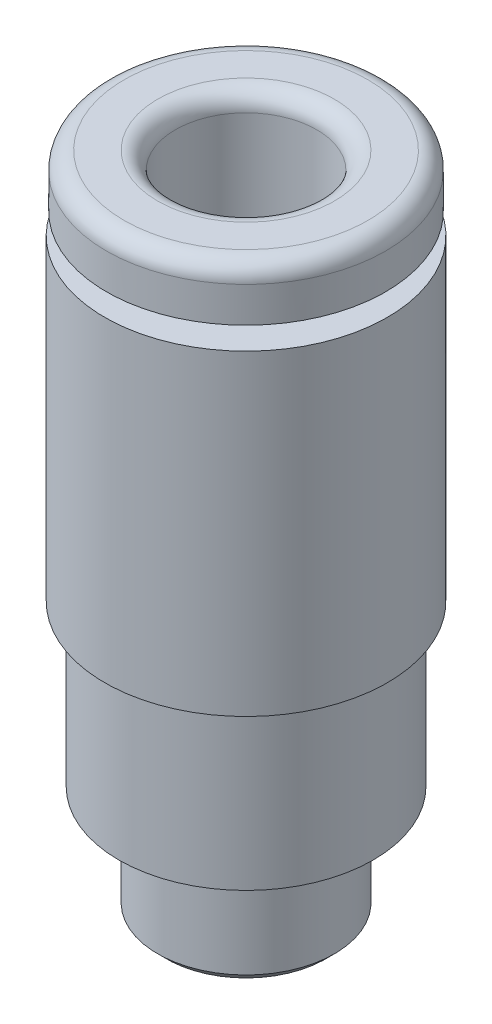
ISO-10303-21;
HEADER;
FILE_DESCRIPTION(('STEP AP214'),'2;1');
FILE_NAME('part.step','',(''),(''),'','','');
FILE_SCHEMA(('AUTOMOTIVE_DESIGN { 1 0 10303 214 1 1 1 1 }'));
ENDSEC;
DATA;
#1=APPLICATION_CONTEXT('core data for automotive mechanical design processes');
#2=APPLICATION_PROTOCOL_DEFINITION('international standard','automotive_design',2000,#1);
#3=PRODUCT_CONTEXT('',#1,'mechanical');
#4=PRODUCT('Part','Part','',(#3));
#5=PRODUCT_RELATED_PRODUCT_CATEGORY('part','',(#4));
#6=PRODUCT_DEFINITION_FORMATION('','',#4);
#7=PRODUCT_DEFINITION_CONTEXT('part definition',#1,'design');
#8=PRODUCT_DEFINITION('design','',#6,#7);
#9=PRODUCT_DEFINITION_SHAPE('','',#8);
#10=(LENGTH_UNIT() NAMED_UNIT(*) SI_UNIT(.MILLI.,.METRE.));
#11=(NAMED_UNIT(*) PLANE_ANGLE_UNIT() SI_UNIT($,.RADIAN.));
#12=(NAMED_UNIT(*) SI_UNIT($,.STERADIAN.) SOLID_ANGLE_UNIT());
#13=UNCERTAINTY_MEASURE_WITH_UNIT(LENGTH_MEASURE(1.E-05),#10,'distance_accuracy_value','');
#14=(GEOMETRIC_REPRESENTATION_CONTEXT(3) GLOBAL_UNCERTAINTY_ASSIGNED_CONTEXT((#13)) GLOBAL_UNIT_ASSIGNED_CONTEXT((#10,
#11,#12)) REPRESENTATION_CONTEXT('',''));
#15=CARTESIAN_POINT('',(0.,0.,0.));
#16=DIRECTION('',(0.,0.,1.));
#17=DIRECTION('',(1.,0.,0.));
#18=AXIS2_PLACEMENT_3D('',#15,#16,#17);
#19=CARTESIAN_POINT('',(0.,-14.7,0.));
#20=DIRECTION('',(0.,1.,0.));
#21=DIRECTION('',(0.,0.,1.));
#22=AXIS2_PLACEMENT_3D('',#19,#20,#21);
#23=PLANE('',#22);
#24=CARTESIAN_POINT('',(0.,-14.7,0.));
#25=DIRECTION('',(0.,1.,0.));
#26=DIRECTION('',(0.,0.,1.));
#27=AXIS2_PLACEMENT_3D('',#24,#25,#26);
#28=CIRCLE('',#27,1.18015846101649);
#29=CARTESIAN_POINT('',(0.,-14.7000000000019,1.18015846101649));
#30=VERTEX_POINT('',#29);
#31=CARTESIAN_POINT('',(1.02204720773143,-14.7000000000019,0.590079230508244));
#32=VERTEX_POINT('',#31);
#33=EDGE_CURVE('E113',#30,#32,#28,.T.);
#34=ORIENTED_EDGE('',*,*,#33,.F.);
#35=DIRECTION('',(1.,0.,0.));
#36=VECTOR('',#35,1.);
#37=CARTESIAN_POINT('',(0.,-14.7,1.18015846101656));
#38=LINE('',#37,#36);
#39=CARTESIAN_POINT('',(0.681364805154325,-14.7,1.18015846101656));
#40=VERTEX_POINT('',#39);
#41=EDGE_CURVE('E123',#30,#40,#38,.T.);
#42=ORIENTED_EDGE('',*,*,#41,.T.);
#43=DIRECTION('',(0.499999999999999,0.,-0.866025403784439));
#44=VECTOR('',#43,1.);
#45=CARTESIAN_POINT('',(1.02204720773149,-14.7,0.590079230508277));
#46=LINE('',#45,#44);
#47=EDGE_CURVE('E126',#40,#32,#46,.T.);
#48=ORIENTED_EDGE('',*,*,#47,.T.);
#49=EDGE_LOOP('',(#34,#42,#48));
#50=FACE_BOUND('',#49,.T.);
#51=ADVANCED_FACE('F41',(#50),#23,.T.);
#52=CARTESIAN_POINT('',(1.02204720773143,-14.7000000000019,-0.590079230508246));
#53=VERTEX_POINT('',#52);
#54=EDGE_CURVE('E128',#32,#53,#28,.T.);
#55=ORIENTED_EDGE('',*,*,#54,.F.);
#56=CARTESIAN_POINT('',(1.36272961030865,-14.7,0.));
#57=VERTEX_POINT('',#56);
#58=EDGE_CURVE('E142',#32,#57,#46,.T.);
#59=ORIENTED_EDGE('',*,*,#58,.T.);
#60=DIRECTION('',(-0.5,0.,-0.866025403784438));
#61=VECTOR('',#60,1.);
#62=CARTESIAN_POINT('',(1.02204720773149,-14.7,-0.590079230508279));
#63=LINE('',#62,#61);
#64=EDGE_CURVE('E306',#57,#53,#63,.T.);
#65=ORIENTED_EDGE('',*,*,#64,.T.);
#66=EDGE_LOOP('',(#55,#59,#65));
#67=FACE_BOUND('',#66,.T.);
#68=ADVANCED_FACE('F256',(#67),#23,.T.);
#69=CARTESIAN_POINT('',(0.,-14.7000000000019,-1.18015846101649));
#70=VERTEX_POINT('',#69);
#71=EDGE_CURVE('E321',#53,#70,#28,.T.);
#72=ORIENTED_EDGE('',*,*,#71,.F.);
#73=CARTESIAN_POINT('',(0.681364805154323,-14.7,-1.18015846101656));
#74=VERTEX_POINT('',#73);
#75=EDGE_CURVE('E311',#53,#74,#63,.T.);
#76=ORIENTED_EDGE('',*,*,#75,.T.);
#77=DIRECTION('',(-1.,0.,0.));
#78=VECTOR('',#77,1.);
#79=CARTESIAN_POINT('',(0.,-14.7,-1.18015846101656));
#80=LINE('',#79,#78);
#81=EDGE_CURVE('E292',#74,#70,#80,.T.);
#82=ORIENTED_EDGE('',*,*,#81,.T.);
#83=EDGE_LOOP('',(#72,#76,#82));
#84=FACE_BOUND('',#83,.T.);
#85=ADVANCED_FACE('F261',(#84),#23,.T.);
#86=CARTESIAN_POINT('',(-1.02204720773143,-14.7000000000019,-0.590079230508245));
#87=VERTEX_POINT('',#86);
#88=EDGE_CURVE('E287',#70,#87,#28,.T.);
#89=ORIENTED_EDGE('',*,*,#88,.F.);
#90=CARTESIAN_POINT('',(-0.681364805154325,-14.7,-1.18015846101656));
#91=VERTEX_POINT('',#90);
#92=EDGE_CURVE('E295',#70,#91,#80,.T.);
#93=ORIENTED_EDGE('',*,*,#92,.T.);
#94=DIRECTION('',(-0.5,0.,0.866025403784439));
#95=VECTOR('',#94,1.);
#96=CARTESIAN_POINT('',(-1.02204720773149,-14.7,-0.590079230508279));
#97=LINE('',#96,#95);
#98=EDGE_CURVE('E148',#91,#87,#97,.T.);
#99=ORIENTED_EDGE('',*,*,#98,.T.);
#100=EDGE_LOOP('',(#89,#93,#99));
#101=FACE_BOUND('',#100,.T.);
#102=ADVANCED_FACE('F278',(#101),#23,.T.);
#103=CARTESIAN_POINT('',(-1.02204720773143,-14.7000000000019,0.590079230508245));
#104=VERTEX_POINT('',#103);
#105=EDGE_CURVE('E56',#87,#104,#28,.T.);
#106=ORIENTED_EDGE('',*,*,#105,.F.);
#107=CARTESIAN_POINT('',(-1.36272961030865,-14.7,0.));
#108=VERTEX_POINT('',#107);
#109=EDGE_CURVE('E151',#87,#108,#97,.T.);
#110=ORIENTED_EDGE('',*,*,#109,.T.);
#111=DIRECTION('',(0.5,0.,0.866025403784439));
#112=VECTOR('',#111,1.);
#113=CARTESIAN_POINT('',(-1.02204720773149,-14.7,0.590079230508278));
#114=LINE('',#113,#112);
#115=EDGE_CURVE('E137',#108,#104,#114,.T.);
#116=ORIENTED_EDGE('',*,*,#115,.T.);
#117=EDGE_LOOP('',(#106,#110,#116));
#118=FACE_BOUND('',#117,.T.);
#119=ADVANCED_FACE('F205',(#118),#23,.T.);
#120=CARTESIAN_POINT('',(0.,0.,0.));
#121=DIRECTION('',(0.,-1.,0.));
#122=DIRECTION('',(0.,0.,-1.));
#123=AXIS2_PLACEMENT_3D('',#120,#121,#122);
#124=CYLINDRICAL_SURFACE('',#123,3.95);
#125=CARTESIAN_POINT('',(0.,-0.5,0.));
#126=DIRECTION('',(0.,1.,0.));
#127=DIRECTION('',(0.,0.,1.));
#128=AXIS2_PLACEMENT_3D('',#125,#126,#127);
#129=CIRCLE('',#128,3.95);
#130=CARTESIAN_POINT('',(0.,-0.5,3.95));
#131=VERTEX_POINT('',#130);
#132=EDGE_CURVE('E185',#131,#131,#129,.F.);
#133=ORIENTED_EDGE('',*,*,#132,.T.);
#134=EDGE_LOOP('',(#133));
#135=FACE_BOUND('',#134,.T.);
#136=CARTESIAN_POINT('',(0.,-1.5,0.));
#137=DIRECTION('',(0.,-1.,0.));
#138=DIRECTION('',(0.,0.,-1.));
#139=AXIS2_PLACEMENT_3D('',#136,#137,#138);
#140=CIRCLE('',#139,3.95);
#141=CARTESIAN_POINT('',(0.,-1.5,-3.95));
#142=VERTEX_POINT('',#141);
#143=EDGE_CURVE('E157',#142,#142,#140,.T.);
#144=ORIENTED_EDGE('',*,*,#143,.F.);
#145=EDGE_LOOP('',(#144));
#146=FACE_BOUND('',#145,.T.);
#147=ADVANCED_FACE('F202',(#135,#146),#124,.T.);
#148=CARTESIAN_POINT('',(3.95,0.,0.));
#149=DIRECTION('',(0.,1.,0.));
#150=DIRECTION('',(0.,0.,1.));
#151=AXIS2_PLACEMENT_3D('',#148,#149,#150);
#152=PLANE('',#151);
#153=CARTESIAN_POINT('',(0.,0.,0.));
#154=DIRECTION('',(0.,1.,0.));
#155=DIRECTION('',(0.,0.,1.));
#156=AXIS2_PLACEMENT_3D('',#153,#154,#155);
#157=CIRCLE('',#156,3.45);
#158=CARTESIAN_POINT('',(0.,0.,3.45));
#159=VERTEX_POINT('',#158);
#160=EDGE_CURVE('E49',#159,#159,#157,.T.);
#161=ORIENTED_EDGE('',*,*,#160,.T.);
#162=EDGE_LOOP('',(#161));
#163=FACE_BOUND('',#162,.T.);
#164=CARTESIAN_POINT('',(0.,0.,0.));
#165=DIRECTION('',(0.,1.,0.));
#166=DIRECTION('',(0.,0.,1.));
#167=AXIS2_PLACEMENT_3D('',#164,#165,#166);
#168=CIRCLE('',#167,2.5);
#169=CARTESIAN_POINT('',(0.,0.,2.5));
#170=VERTEX_POINT('',#169);
#171=EDGE_CURVE('E188',#170,#170,#168,.F.);
#172=ORIENTED_EDGE('',*,*,#171,.T.);
#173=EDGE_LOOP('',(#172));
#174=FACE_BOUND('',#173,.T.);
#175=ADVANCED_FACE('F193',(#163,#174),#152,.T.);
#176=CARTESIAN_POINT('',(0.,-15.6,0.));
#177=DIRECTION('',(0.,-1.,0.));
#178=DIRECTION('',(0.,0.,-1.));
#179=AXIS2_PLACEMENT_3D('',#176,#177,#178);
#180=PLANE('',#179);
#181=CARTESIAN_POINT('',(0.,-15.6,0.));
#182=DIRECTION('',(0.,-1.,0.));
#183=DIRECTION('',(0.,0.,-1.));
#184=AXIS2_PLACEMENT_3D('',#181,#182,#183);
#185=CIRCLE('',#184,2.5);
#186=CARTESIAN_POINT('',(0.,-15.6,-2.5));
#187=VERTEX_POINT('',#186);
#188=EDGE_CURVE('E152',#187,#187,#185,.T.);
#189=ORIENTED_EDGE('',*,*,#188,.F.);
#190=EDGE_LOOP('',(#189));
#191=FACE_BOUND('',#190,.T.);
#192=CARTESIAN_POINT('',(0.,-15.6,0.));
#193=DIRECTION('',(0.,-1.,0.));
#194=DIRECTION('',(0.,0.,-1.));
#195=AXIS2_PLACEMENT_3D('',#192,#193,#194);
#196=CIRCLE('',#195,3.6);
#197=CARTESIAN_POINT('',(0.,-15.6,-3.6));
#198=VERTEX_POINT('',#197);
#199=EDGE_CURVE('E156',#198,#198,#196,.T.);
#200=ORIENTED_EDGE('',*,*,#199,.T.);
#201=EDGE_LOOP('',(#200));
#202=FACE_BOUND('',#201,.T.);
#203=ADVANCED_FACE('F243',(#191,#202),#180,.T.);
#204=CARTESIAN_POINT('',(0.,0.,0.));
#205=DIRECTION('',(0.,-1.,0.));
#206=DIRECTION('',(0.,0.,-1.));
#207=AXIS2_PLACEMENT_3D('',#204,#205,#206);
#208=CYLINDRICAL_SURFACE('',#207,3.6);
#209=CARTESIAN_POINT('',(0.,-11.2,0.));
#210=DIRECTION('',(0.,-1.,0.));
#211=DIRECTION('',(0.,0.,-1.));
#212=AXIS2_PLACEMENT_3D('',#209,#210,#211);
#213=CIRCLE('',#212,3.6);
#214=CARTESIAN_POINT('',(0.,-11.2,-3.6));
#215=VERTEX_POINT('',#214);
#216=EDGE_CURVE('E173',#215,#215,#213,.T.);
#217=ORIENTED_EDGE('',*,*,#216,.T.);
#218=EDGE_LOOP('',(#217));
#219=FACE_BOUND('',#218,.T.);
#220=ORIENTED_EDGE('',*,*,#199,.F.);
#221=EDGE_LOOP('',(#220));
#222=FACE_BOUND('',#221,.T.);
#223=ADVANCED_FACE('F237',(#219,#222),#208,.T.);
#224=CARTESIAN_POINT('',(0.,-11.2,0.));
#225=DIRECTION('',(0.,1.,0.));
#226=DIRECTION('',(0.,0.,1.));
#227=AXIS2_PLACEMENT_3D('',#224,#225,#226);
#228=CONICAL_SURFACE('',#227,3.6,1.22173047639603);
#229=CARTESIAN_POINT('',(0.,-11.0544119062935,0.));
#230=DIRECTION('',(0.,-1.,0.));
#231=DIRECTION('',(0.,0.,-1.));
#232=AXIS2_PLACEMENT_3D('',#229,#230,#231);
#233=CIRCLE('',#232,4.);
#234=CARTESIAN_POINT('',(0.,-11.0544119062935,-4.));
#235=VERTEX_POINT('',#234);
#236=EDGE_CURVE('E170',#235,#235,#233,.T.);
#237=ORIENTED_EDGE('',*,*,#236,.T.);
#238=EDGE_LOOP('',(#237));
#239=FACE_BOUND('',#238,.T.);
#240=ORIENTED_EDGE('',*,*,#216,.F.);
#241=EDGE_LOOP('',(#240));
#242=FACE_BOUND('',#241,.T.);
#243=ADVANCED_FACE('F231',(#239,#242),#228,.T.);
#244=CARTESIAN_POINT('',(0.,0.,0.));
#245=DIRECTION('',(0.,-1.,0.));
#246=DIRECTION('',(0.,0.,-1.));
#247=AXIS2_PLACEMENT_3D('',#244,#245,#246);
#248=CYLINDRICAL_SURFACE('',#247,4.);
#249=CARTESIAN_POINT('',(0.,-2.1,0.));
#250=DIRECTION('',(0.,-1.,0.));
#251=DIRECTION('',(0.,0.,-1.));
#252=AXIS2_PLACEMENT_3D('',#249,#250,#251);
#253=CIRCLE('',#252,4.);
#254=CARTESIAN_POINT('',(0.,-2.1,-4.));
#255=VERTEX_POINT('',#254);
#256=EDGE_CURVE('E167',#255,#255,#253,.T.);
#257=ORIENTED_EDGE('',*,*,#256,.T.);
#258=EDGE_LOOP('',(#257));
#259=FACE_BOUND('',#258,.T.);
#260=ORIENTED_EDGE('',*,*,#236,.F.);
#261=EDGE_LOOP('',(#260));
#262=FACE_BOUND('',#261,.T.);
#263=ADVANCED_FACE('F225',(#259,#262),#248,.T.);
#264=CARTESIAN_POINT('',(4.,-2.1,0.));
#265=DIRECTION('',(0.,1.,0.));
#266=DIRECTION('',(0.,0.,1.));
#267=AXIS2_PLACEMENT_3D('',#264,#265,#266);
#268=PLANE('',#267);
#269=CARTESIAN_POINT('',(0.,-2.1,0.));
#270=DIRECTION('',(0.,-1.,0.));
#271=DIRECTION('',(0.,0.,-1.));
#272=AXIS2_PLACEMENT_3D('',#269,#270,#271);
#273=CIRCLE('',#272,2.2);
#274=CARTESIAN_POINT('',(0.,-2.1,-2.2));
#275=VERTEX_POINT('',#274);
#276=EDGE_CURVE('E164',#275,#275,#273,.T.);
#277=ORIENTED_EDGE('',*,*,#276,.T.);
#278=EDGE_LOOP('',(#277));
#279=FACE_BOUND('',#278,.T.);
#280=ORIENTED_EDGE('',*,*,#256,.F.);
#281=EDGE_LOOP('',(#280));
#282=FACE_BOUND('',#281,.T.);
#283=ADVANCED_FACE('F219',(#279,#282),#268,.T.);
#284=CARTESIAN_POINT('',(0.,0.,0.));
#285=DIRECTION('',(0.,-1.,0.));
#286=DIRECTION('',(0.,0.,-1.));
#287=AXIS2_PLACEMENT_3D('',#284,#285,#286);
#288=CYLINDRICAL_SURFACE('',#287,2.2);
#289=CARTESIAN_POINT('',(0.,-1.5,0.));
#290=DIRECTION('',(0.,-1.,0.));
#291=DIRECTION('',(0.,0.,-1.));
#292=AXIS2_PLACEMENT_3D('',#289,#290,#291);
#293=CIRCLE('',#292,2.2);
#294=CARTESIAN_POINT('',(0.,-1.5,-2.2));
#295=VERTEX_POINT('',#294);
#296=EDGE_CURVE('E160',#295,#295,#293,.T.);
#297=ORIENTED_EDGE('',*,*,#296,.T.);
#298=EDGE_LOOP('',(#297));
#299=FACE_BOUND('',#298,.T.);
#300=ORIENTED_EDGE('',*,*,#276,.F.);
#301=EDGE_LOOP('',(#300));
#302=FACE_BOUND('',#301,.T.);
#303=ADVANCED_FACE('F213',(#299,#302),#288,.T.);
#304=CARTESIAN_POINT('',(2.2,-1.5,0.));
#305=DIRECTION('',(0.,-1.,0.));
#306=DIRECTION('',(0.,0.,-1.));
#307=AXIS2_PLACEMENT_3D('',#304,#305,#306);
#308=PLANE('',#307);
#309=ORIENTED_EDGE('',*,*,#143,.T.);
#310=EDGE_LOOP('',(#309));
#311=FACE_BOUND('',#310,.T.);
#312=ORIENTED_EDGE('',*,*,#296,.F.);
#313=EDGE_LOOP('',(#312));
#314=FACE_BOUND('',#313,.T.);
#315=ADVANCED_FACE('F209',(#311,#314),#308,.T.);
#316=CARTESIAN_POINT('',(0.,-18.7,0.));
#317=DIRECTION('',(0.,1.,0.));
#318=DIRECTION('',(0.,0.,1.));
#319=AXIS2_PLACEMENT_3D('',#316,#317,#318);
#320=CYLINDRICAL_SURFACE('',#319,2.5);
#321=CARTESIAN_POINT('',(0.,-18.45,0.));
#322=DIRECTION('',(0.,-1.,0.));
#323=DIRECTION('',(0.,0.,-1.));
#324=AXIS2_PLACEMENT_3D('',#321,#322,#323);
#325=CIRCLE('',#324,2.5);
#326=CARTESIAN_POINT('',(0.,-18.45,-2.5));
#327=VERTEX_POINT('',#326);
#328=EDGE_CURVE('E182',#327,#327,#325,.F.);
#329=ORIENTED_EDGE('',*,*,#328,.T.);
#330=EDGE_LOOP('',(#329));
#331=FACE_BOUND('',#330,.T.);
#332=ORIENTED_EDGE('',*,*,#188,.T.);
#333=EDGE_LOOP('',(#332));
#334=FACE_BOUND('',#333,.T.);
#335=ADVANCED_FACE('F212',(#331,#334),#320,.T.);
#336=CARTESIAN_POINT('',(0.,-18.7,0.));
#337=DIRECTION('',(0.,-1.,0.));
#338=DIRECTION('',(0.,0.,-1.));
#339=AXIS2_PLACEMENT_3D('',#336,#337,#338);
#340=PLANE('',#339);
#341=CARTESIAN_POINT('',(0.,-18.7,0.));
#342=DIRECTION('',(0.,-1.,0.));
#343=DIRECTION('',(0.,0.,-1.));
#344=AXIS2_PLACEMENT_3D('',#341,#342,#343);
#345=CIRCLE('',#344,2.25);
#346=CARTESIAN_POINT('',(0.,-18.7,-2.25));
#347=VERTEX_POINT('',#346);
#348=EDGE_CURVE('E179',#347,#347,#345,.T.);
#349=ORIENTED_EDGE('',*,*,#348,.T.);
#350=EDGE_LOOP('',(#349));
#351=FACE_BOUND('',#350,.T.);
#352=CARTESIAN_POINT('',(0.,-18.7,0.));
#353=DIRECTION('',(0.,-1.,0.));
#354=DIRECTION('',(0.,0.,-1.));
#355=AXIS2_PLACEMENT_3D('',#352,#353,#354);
#356=CIRCLE('',#355,1.18015846101649);
#357=CARTESIAN_POINT('',(0.,-18.7,-1.18015846101649));
#358=VERTEX_POINT('',#357);
#359=EDGE_CURVE('E118',#358,#358,#356,.T.);
#360=ORIENTED_EDGE('',*,*,#359,.F.);
#361=EDGE_LOOP('',(#360));
#362=FACE_BOUND('',#361,.T.);
#363=ADVANCED_FACE('F343',(#351,#362),#340,.T.);
#364=CARTESIAN_POINT('',(0.,-12.7,2.));
#365=DIRECTION('',(0.,-1.,0.));
#366=DIRECTION('',(0.,0.,-1.));
#367=AXIS2_PLACEMENT_3D('',#364,#365,#366);
#368=PLANE('',#367);
#369=CARTESIAN_POINT('',(0.,-12.7,0.));
#370=DIRECTION('',(0.,1.,0.));
#371=DIRECTION('',(0.,0.,1.));
#372=AXIS2_PLACEMENT_3D('',#369,#370,#371);
#373=CIRCLE('',#372,2.);
#374=CARTESIAN_POINT('',(0.,-12.7,2.));
#375=VERTEX_POINT('',#374);
#376=EDGE_CURVE('E127',#375,#375,#373,.T.);
#377=ORIENTED_EDGE('',*,*,#376,.T.);
#378=EDGE_LOOP('',(#377));
#379=FACE_BOUND('',#378,.T.);
#380=DIRECTION('',(-0.5,0.,-0.866025403784438));
#381=VECTOR('',#380,1.);
#382=CARTESIAN_POINT('',(1.57140129745555,-12.7,0.221746886272575));
#383=LINE('',#382,#381);
#384=CARTESIAN_POINT('',(1.44337567297412,-12.7,0.));
#385=VERTEX_POINT('',#384);
#386=CARTESIAN_POINT('',(0.721687836487058,-12.7,-1.25000000000005));
#387=VERTEX_POINT('',#386);
#388=EDGE_CURVE('E328',#385,#387,#383,.T.);
#389=ORIENTED_EDGE('',*,*,#388,.F.);
#390=DIRECTION('',(0.499999999999999,0.,-0.866025403784439));
#391=VECTOR('',#390,1.);
#392=CARTESIAN_POINT('',(0.593662212005627,-12.7,1.47174688627262));
#393=LINE('',#392,#391);
#394=CARTESIAN_POINT('',(0.721687836487059,-12.7,1.25000000000005));
#395=VERTEX_POINT('',#394);
#396=EDGE_CURVE('E331',#395,#385,#393,.T.);
#397=ORIENTED_EDGE('',*,*,#396,.F.);
#398=DIRECTION('',(1.,0.,0.));
#399=VECTOR('',#398,1.);
#400=CARTESIAN_POINT('',(-0.977739085449924,-12.7,1.25000000000005));
#401=LINE('',#400,#399);
#402=CARTESIAN_POINT('',(-0.721687836487058,-12.7,1.25000000000005));
#403=VERTEX_POINT('',#402);
#404=EDGE_CURVE('E333',#403,#395,#401,.T.);
#405=ORIENTED_EDGE('',*,*,#404,.F.);
#406=DIRECTION('',(0.5,0.,0.866025403784439));
#407=VECTOR('',#406,1.);
#408=CARTESIAN_POINT('',(-1.57140129745555,-12.7,-0.221746886272577));
#409=LINE('',#408,#407);
#410=CARTESIAN_POINT('',(-1.44337567297412,-12.7,0.));
#411=VERTEX_POINT('',#410);
#412=EDGE_CURVE('E64',#411,#403,#409,.T.);
#413=ORIENTED_EDGE('',*,*,#412,.F.);
#414=DIRECTION('',(-0.5,0.,0.866025403784439));
#415=VECTOR('',#414,1.);
#416=CARTESIAN_POINT('',(-0.593662212005626,-12.7,-1.47174688627262));
#417=LINE('',#416,#415);
#418=CARTESIAN_POINT('',(-0.721687836487059,-12.7,-1.25000000000005));
#419=VERTEX_POINT('',#418);
#420=EDGE_CURVE('E155',#419,#411,#417,.T.);
#421=ORIENTED_EDGE('',*,*,#420,.F.);
#422=DIRECTION('',(-1.,0.,0.));
#423=VECTOR('',#422,1.);
#424=CARTESIAN_POINT('',(0.977739085449924,-12.7,-1.25000000000005));
#425=LINE('',#424,#423);
#426=EDGE_CURVE('E300',#387,#419,#425,.T.);
#427=ORIENTED_EDGE('',*,*,#426,.F.);
#428=EDGE_LOOP('',(#389,#397,#405,#413,#421,#427));
#429=FACE_BOUND('',#428,.T.);
#430=ADVANCED_FACE('F275',(#379,#429),#368,.F.);
#431=CARTESIAN_POINT('',(0.,-12.7,0.));
#432=DIRECTION('',(0.,1.,0.));
#433=DIRECTION('',(0.,0.,1.));
#434=AXIS2_PLACEMENT_3D('',#431,#432,#433);
#435=CYLINDRICAL_SURFACE('',#434,2.);
#436=CARTESIAN_POINT('',(0.,-0.5,0.));
#437=DIRECTION('',(0.,1.,0.));
#438=DIRECTION('',(0.,0.,1.));
#439=AXIS2_PLACEMENT_3D('',#436,#437,#438);
#440=CIRCLE('',#439,2.);
#441=CARTESIAN_POINT('',(0.,-0.5,2.));
#442=VERTEX_POINT('',#441);
#443=EDGE_CURVE('E11',#442,#442,#440,.T.);
#444=ORIENTED_EDGE('',*,*,#443,.T.);
#445=EDGE_LOOP('',(#444));
#446=FACE_BOUND('',#445,.T.);
#447=ORIENTED_EDGE('',*,*,#376,.F.);
#448=EDGE_LOOP('',(#447));
#449=FACE_BOUND('',#448,.T.);
#450=ADVANCED_FACE('F267',(#446,#449),#435,.F.);
#451=EDGE_CURVE('E109',#104,#30,#28,.T.);
#452=ORIENTED_EDGE('',*,*,#451,.F.);
#453=CARTESIAN_POINT('',(-0.681364805154323,-14.7,1.18015846101656));
#454=VERTEX_POINT('',#453);
#455=EDGE_CURVE('E140',#104,#454,#114,.T.);
#456=ORIENTED_EDGE('',*,*,#455,.T.);
#457=EDGE_CURVE('E133',#454,#30,#38,.T.);
#458=ORIENTED_EDGE('',*,*,#457,.T.);
#459=EDGE_LOOP('',(#452,#456,#458));
#460=FACE_BOUND('',#459,.T.);
#461=ADVANCED_FACE('F139',(#460),#23,.T.);
#462=CARTESIAN_POINT('',(-0.977739085449925,0.,-1.6934937725452));
#463=DIRECTION('',(-0.865497844507677,-0.0348994967024975,-0.499695413509548));
#464=DIRECTION('',(-0.5,0.,0.866025403784439));
#465=AXIS2_PLACEMENT_3D('',#462,#463,#464);
#466=PLANE('',#465);
#467=DIRECTION('',(-0.0201451448507182,0.999188016619382,-0.0348924144072785));
#468=VECTOR('',#467,1.);
#469=CARTESIAN_POINT('',(-0.976945499881965,-0.0393614042263926,-1.69211924202134));
#470=LINE('',#469,#468);
#471=EDGE_CURVE('E303',#91,#419,#470,.T.);
#472=ORIENTED_EDGE('',*,*,#471,.T.);
#473=ORIENTED_EDGE('',*,*,#420,.T.);
#474=DIRECTION('',(-0.0402902897014365,0.999188016619382,0.));
#475=VECTOR('',#474,1.);
#476=CARTESIAN_POINT('',(-1.95389099976393,-0.0393614042263926,0.));
#477=LINE('',#476,#475);
#478=EDGE_CURVE('E291',#108,#411,#477,.T.);
#479=ORIENTED_EDGE('',*,*,#478,.F.);
#480=ORIENTED_EDGE('',*,*,#109,.F.);
#481=ORIENTED_EDGE('',*,*,#98,.F.);
#482=EDGE_LOOP('',(#472,#473,#479,#480,#481));
#483=FACE_BOUND('',#482,.T.);
#484=ADVANCED_FACE('F266',(#483),#466,.F.);
#485=CARTESIAN_POINT('',(-1.95547817089985,0.,0.));
#486=DIRECTION('',(-0.865497844507677,-0.0348994967024975,0.499695413509548));
#487=DIRECTION('',(0.5,0.,0.866025403784439));
#488=AXIS2_PLACEMENT_3D('',#485,#486,#487);
#489=PLANE('',#488);
#490=ORIENTED_EDGE('',*,*,#478,.T.);
#491=ORIENTED_EDGE('',*,*,#412,.T.);
#492=DIRECTION('',(-0.0201451448507182,0.999188016619382,0.0348924144072785));
#493=VECTOR('',#492,1.);
#494=CARTESIAN_POINT('',(-0.976945499881963,-0.0393614042263926,1.69211924202134));
#495=LINE('',#494,#493);
#496=EDGE_CURVE('E308',#454,#403,#495,.T.);
#497=ORIENTED_EDGE('',*,*,#496,.F.);
#498=ORIENTED_EDGE('',*,*,#455,.F.);
#499=ORIENTED_EDGE('',*,*,#115,.F.);
#500=EDGE_LOOP('',(#490,#491,#497,#498,#499));
#501=FACE_BOUND('',#500,.T.);
#502=ADVANCED_FACE('F272',(#501),#489,.F.);
#503=CARTESIAN_POINT('',(-0.977739085449924,0.,1.6934937725452));
#504=DIRECTION('',(0.,-0.0348994967024975,0.999390827019096));
#505=DIRECTION('',(0.,-0.999390827019096,-0.0348994967024975));
#506=AXIS2_PLACEMENT_3D('',#503,#504,#505);
#507=PLANE('',#506);
#508=ORIENTED_EDGE('',*,*,#496,.T.);
#509=ORIENTED_EDGE('',*,*,#404,.T.);
#510=DIRECTION('',(0.0201451448507183,0.999188016619382,0.0348924144072785));
#511=VECTOR('',#510,1.);
#512=CARTESIAN_POINT('',(0.976945499881965,-0.0393614042263927,1.69211924202134));
#513=LINE('',#512,#511);
#514=EDGE_CURVE('E136',#40,#395,#513,.T.);
#515=ORIENTED_EDGE('',*,*,#514,.F.);
#516=ORIENTED_EDGE('',*,*,#41,.F.);
#517=ORIENTED_EDGE('',*,*,#457,.F.);
#518=EDGE_LOOP('',(#508,#509,#515,#516,#517));
#519=FACE_BOUND('',#518,.T.);
#520=ADVANCED_FACE('F132',(#519),#507,.F.);
#521=CARTESIAN_POINT('',(0.977739085449926,0.,1.6934937725452));
#522=DIRECTION('',(0.865497844507677,-0.0348994967024975,0.499695413509547));
#523=DIRECTION('',(0.499999999999999,0.,-0.866025403784439));
#524=AXIS2_PLACEMENT_3D('',#521,#522,#523);
#525=PLANE('',#524);
#526=ORIENTED_EDGE('',*,*,#514,.T.);
#527=ORIENTED_EDGE('',*,*,#396,.T.);
#528=DIRECTION('',(0.0402902897014365,0.999188016619382,0.));
#529=VECTOR('',#528,1.);
#530=CARTESIAN_POINT('',(1.95389099976393,-0.0393614042263926,0.));
#531=LINE('',#530,#529);
#532=EDGE_CURVE('E317',#57,#385,#531,.T.);
#533=ORIENTED_EDGE('',*,*,#532,.F.);
#534=ORIENTED_EDGE('',*,*,#58,.F.);
#535=ORIENTED_EDGE('',*,*,#47,.F.);
#536=EDGE_LOOP('',(#526,#527,#533,#534,#535));
#537=FACE_BOUND('',#536,.T.);
#538=ADVANCED_FACE('F358',(#537),#525,.F.);
#539=CARTESIAN_POINT('',(1.95547817089985,0.,0.));
#540=DIRECTION('',(0.865497844507676,-0.0348994967024975,-0.499695413509548));
#541=DIRECTION('',(-0.5,0.,-0.866025403784438));
#542=AXIS2_PLACEMENT_3D('',#539,#540,#541);
#543=PLANE('',#542);
#544=ORIENTED_EDGE('',*,*,#532,.T.);
#545=ORIENTED_EDGE('',*,*,#388,.T.);
#546=DIRECTION('',(0.0201451448507182,0.999188016619382,-0.0348924144072785));
#547=VECTOR('',#546,1.);
#548=CARTESIAN_POINT('',(0.976945499881963,-0.0393614042263926,-1.69211924202134));
#549=LINE('',#548,#547);
#550=EDGE_CURVE('E161',#74,#387,#549,.T.);
#551=ORIENTED_EDGE('',*,*,#550,.F.);
#552=ORIENTED_EDGE('',*,*,#75,.F.);
#553=ORIENTED_EDGE('',*,*,#64,.F.);
#554=EDGE_LOOP('',(#544,#545,#551,#552,#553));
#555=FACE_BOUND('',#554,.T.);
#556=ADVANCED_FACE('F326',(#555),#543,.F.);
#557=CARTESIAN_POINT('',(0.977739085449924,0.,-1.6934937725452));
#558=DIRECTION('',(0.,-0.0348994967024975,-0.999390827019096));
#559=DIRECTION('',(0.,0.999390827019096,-0.0348994967024975));
#560=AXIS2_PLACEMENT_3D('',#557,#558,#559);
#561=PLANE('',#560);
#562=ORIENTED_EDGE('',*,*,#550,.T.);
#563=ORIENTED_EDGE('',*,*,#426,.T.);
#564=ORIENTED_EDGE('',*,*,#471,.F.);
#565=ORIENTED_EDGE('',*,*,#92,.F.);
#566=ORIENTED_EDGE('',*,*,#81,.F.);
#567=EDGE_LOOP('',(#562,#563,#564,#565,#566));
#568=FACE_BOUND('',#567,.T.);
#569=ADVANCED_FACE('F305',(#568),#561,.F.);
#570=CARTESIAN_POINT('',(0.,-18.7,0.));
#571=DIRECTION('',(0.,-1.,0.));
#572=DIRECTION('',(0.,0.,-1.));
#573=AXIS2_PLACEMENT_3D('',#570,#571,#572);
#574=CYLINDRICAL_SURFACE('',#573,1.18015846101649);
#575=ORIENTED_EDGE('',*,*,#33,.T.);
#576=ORIENTED_EDGE('',*,*,#54,.T.);
#577=ORIENTED_EDGE('',*,*,#71,.T.);
#578=ORIENTED_EDGE('',*,*,#88,.T.);
#579=ORIENTED_EDGE('',*,*,#105,.T.);
#580=ORIENTED_EDGE('',*,*,#451,.T.);
#581=EDGE_LOOP('',(#575,#576,#577,#578,#579,#580));
#582=FACE_BOUND('',#581,.T.);
#583=ORIENTED_EDGE('',*,*,#359,.T.);
#584=EDGE_LOOP('',(#583));
#585=FACE_BOUND('',#584,.T.);
#586=ADVANCED_FACE('F111',(#582,#585),#574,.F.);
#587=CARTESIAN_POINT('',(0.,-18.7,0.));
#588=DIRECTION('',(0.,1.,0.));
#589=DIRECTION('',(0.,0.,1.));
#590=AXIS2_PLACEMENT_3D('',#587,#588,#589);
#591=CONICAL_SURFACE('',#590,2.25,0.785398163397444);
#592=ORIENTED_EDGE('',*,*,#328,.F.);
#593=EDGE_LOOP('',(#592));
#594=FACE_BOUND('',#593,.T.);
#595=ORIENTED_EDGE('',*,*,#348,.F.);
#596=EDGE_LOOP('',(#595));
#597=FACE_BOUND('',#596,.T.);
#598=ADVANCED_FACE('F199',(#594,#597),#591,.T.);
#599=CARTESIAN_POINT('',(0.,-0.5,0.));
#600=DIRECTION('',(0.,1.,0.));
#601=DIRECTION('',(0.,0.,1.));
#602=AXIS2_PLACEMENT_3D('',#599,#600,#601);
#603=TOROIDAL_SURFACE('',#602,3.45,0.5);
#604=ORIENTED_EDGE('',*,*,#160,.F.);
#605=EDGE_LOOP('',(#604));
#606=FACE_BOUND('',#605,.T.);
#607=ORIENTED_EDGE('',*,*,#132,.F.);
#608=EDGE_LOOP('',(#607));
#609=FACE_BOUND('',#608,.T.);
#610=ADVANCED_FACE('F196',(#606,#609),#603,.T.);
#611=CARTESIAN_POINT('',(0.,-0.5,0.));
#612=DIRECTION('',(0.,1.,0.));
#613=DIRECTION('',(0.,0.,1.));
#614=AXIS2_PLACEMENT_3D('',#611,#612,#613);
#615=TOROIDAL_SURFACE('',#614,2.5,0.5);
#616=ORIENTED_EDGE('',*,*,#171,.F.);
#617=EDGE_LOOP('',(#616));
#618=FACE_BOUND('',#617,.T.);
#619=ORIENTED_EDGE('',*,*,#443,.F.);
#620=EDGE_LOOP('',(#619));
#621=FACE_BOUND('',#620,.T.);
#622=ADVANCED_FACE('F43',(#618,#621),#615,.T.);
#623=CLOSED_SHELL('',(#51,#68,#85,#102,#119,#147,#175,#203,#223,#243,#263,#283,#303,#315,#335,
#363,#430,#450,#461,#484,#502,#520,#538,#556,#569,#586,#598,#610,#622));
#624=MANIFOLD_SOLID_BREP('B2',#623);
#625=ADVANCED_BREP_SHAPE_REPRESENTATION('',(#18,#624),#14);
#626=SHAPE_DEFINITION_REPRESENTATION(#9,#625);
ENDSEC;
END-ISO-10303-21;
